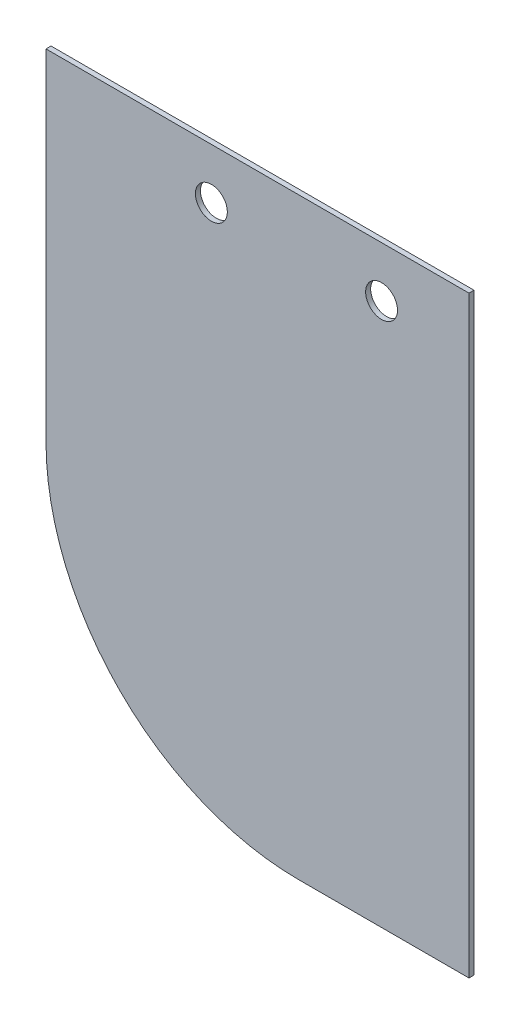
ISO-10303-21;
HEADER;
FILE_DESCRIPTION(('STEP AP214'),'2;1');
FILE_NAME('part.step','',(''),(''),'','','');
FILE_SCHEMA(('AUTOMOTIVE_DESIGN { 1 0 10303 214 1 1 1 1 }'));
ENDSEC;
DATA;
#1=APPLICATION_CONTEXT('core data for automotive mechanical design processes');
#2=APPLICATION_PROTOCOL_DEFINITION('international standard','automotive_design',2000,#1);
#3=PRODUCT_CONTEXT('',#1,'mechanical');
#4=PRODUCT('Part','Part','',(#3));
#5=PRODUCT_RELATED_PRODUCT_CATEGORY('part','',(#4));
#6=PRODUCT_DEFINITION_FORMATION('','',#4);
#7=PRODUCT_DEFINITION_CONTEXT('part definition',#1,'design');
#8=PRODUCT_DEFINITION('design','',#6,#7);
#9=PRODUCT_DEFINITION_SHAPE('','',#8);
#10=(LENGTH_UNIT() NAMED_UNIT(*) SI_UNIT(.MILLI.,.METRE.));
#11=(NAMED_UNIT(*) PLANE_ANGLE_UNIT() SI_UNIT($,.RADIAN.));
#12=(NAMED_UNIT(*) SI_UNIT($,.STERADIAN.) SOLID_ANGLE_UNIT());
#13=UNCERTAINTY_MEASURE_WITH_UNIT(LENGTH_MEASURE(1.E-05),#10,'distance_accuracy_value','');
#14=(GEOMETRIC_REPRESENTATION_CONTEXT(3) GLOBAL_UNCERTAINTY_ASSIGNED_CONTEXT((#13)) GLOBAL_UNIT_ASSIGNED_CONTEXT((#10,
#11,#12)) REPRESENTATION_CONTEXT('',''));
#15=CARTESIAN_POINT('',(0.,0.,0.));
#16=DIRECTION('',(0.,0.,1.));
#17=DIRECTION('',(1.,0.,0.));
#18=AXIS2_PLACEMENT_3D('',#15,#16,#17);
#19=CARTESIAN_POINT('',(-468.975,1066.8,1.5));
#20=DIRECTION('',(0.,0.,1.));
#21=DIRECTION('',(1.,0.,0.));
#22=AXIS2_PLACEMENT_3D('',#19,#20,#21);
#23=PLANE('',#22);
#24=CARTESIAN_POINT('',(-444.2625,1153.3,1.5));
#25=DIRECTION('',(0.,0.,1.));
#26=DIRECTION('',(1.,0.,0.));
#27=AXIS2_PLACEMENT_3D('',#24,#25,#26);
#28=CIRCLE('',#27,4.76250000000003);
#29=CARTESIAN_POINT('',(-439.5,1153.3,1.5));
#30=VERTEX_POINT('',#29);
#31=EDGE_CURVE('E135',#30,#30,#28,.T.);
#32=ORIENTED_EDGE('',*,*,#31,.F.);
#33=EDGE_LOOP('',(#32));
#34=FACE_BOUND('',#33,.T.);
#35=DIRECTION('',(0.,1.,0.));
#36=VECTOR('',#35,1.);
#37=CARTESIAN_POINT('',(-418.175,991.35,1.5));
#38=LINE('',#37,#36);
#39=CARTESIAN_POINT('',(-418.175,991.35,1.5));
#40=VERTEX_POINT('',#39);
#41=CARTESIAN_POINT('',(-418.175,1168.4,1.5));
#42=VERTEX_POINT('',#41);
#43=EDGE_CURVE('E143',#40,#42,#38,.T.);
#44=ORIENTED_EDGE('',*,*,#43,.T.);
#45=DIRECTION('',(-1.,0.,0.));
#46=VECTOR('',#45,1.);
#47=CARTESIAN_POINT('',(-544.425,1168.4,1.5));
#48=LINE('',#47,#46);
#49=CARTESIAN_POINT('',(-544.425,1168.4,1.5));
#50=VERTEX_POINT('',#49);
#51=EDGE_CURVE('E100',#42,#50,#48,.T.);
#52=ORIENTED_EDGE('',*,*,#51,.T.);
#53=DIRECTION('',(0.,-1.,0.));
#54=VECTOR('',#53,1.);
#55=CARTESIAN_POINT('',(-544.425,1066.8,1.5));
#56=LINE('',#55,#54);
#57=CARTESIAN_POINT('',(-544.425,1066.8,1.5));
#58=VERTEX_POINT('',#57);
#59=EDGE_CURVE('E105',#50,#58,#56,.T.);
#60=ORIENTED_EDGE('',*,*,#59,.T.);
#61=CARTESIAN_POINT('',(-468.975,1066.8,1.5));
#62=DIRECTION('',(0.,0.,1.));
#63=DIRECTION('',(1.,0.,0.));
#64=AXIS2_PLACEMENT_3D('',#61,#62,#63);
#65=CIRCLE('',#64,75.45);
#66=CARTESIAN_POINT('',(-468.975,991.35,1.5));
#67=VERTEX_POINT('',#66);
#68=EDGE_CURVE('E109',#58,#67,#65,.T.);
#69=ORIENTED_EDGE('',*,*,#68,.T.);
#70=DIRECTION('',(1.,0.,0.));
#71=VECTOR('',#70,1.);
#72=CARTESIAN_POINT('',(-418.175,991.35,1.5));
#73=LINE('',#72,#71);
#74=EDGE_CURVE('E60',#67,#40,#73,.T.);
#75=ORIENTED_EDGE('',*,*,#74,.T.);
#76=EDGE_LOOP('',(#44,#52,#60,#69,#75));
#77=FACE_BOUND('',#76,.T.);
#78=CARTESIAN_POINT('',(-495.0625,1153.3,1.5));
#79=DIRECTION('',(0.,0.,1.));
#80=DIRECTION('',(1.,0.,0.));
#81=AXIS2_PLACEMENT_3D('',#78,#79,#80);
#82=CIRCLE('',#81,4.76250000000003);
#83=CARTESIAN_POINT('',(-490.3,1153.3,1.5));
#84=VERTEX_POINT('',#83);
#85=EDGE_CURVE('E185',#84,#84,#82,.T.);
#86=ORIENTED_EDGE('',*,*,#85,.F.);
#87=EDGE_LOOP('',(#86));
#88=FACE_BOUND('',#87,.T.);
#89=ADVANCED_FACE('F39',(#34,#77,#88),#23,.T.);
#90=CARTESIAN_POINT('',(-468.975,1066.8,0.));
#91=DIRECTION('',(0.,0.,1.));
#92=DIRECTION('',(1.,0.,0.));
#93=AXIS2_PLACEMENT_3D('',#90,#91,#92);
#94=PLANE('',#93);
#95=CARTESIAN_POINT('',(-444.2625,1153.3,0.));
#96=DIRECTION('',(0.,0.,1.));
#97=DIRECTION('',(1.,0.,0.));
#98=AXIS2_PLACEMENT_3D('',#95,#96,#97);
#99=CIRCLE('',#98,4.76250000000003);
#100=CARTESIAN_POINT('',(-439.5,1153.3,0.));
#101=VERTEX_POINT('',#100);
#102=EDGE_CURVE('E193',#101,#101,#99,.T.);
#103=ORIENTED_EDGE('',*,*,#102,.T.);
#104=EDGE_LOOP('',(#103));
#105=FACE_BOUND('',#104,.T.);
#106=DIRECTION('',(0.,1.,0.));
#107=VECTOR('',#106,1.);
#108=CARTESIAN_POINT('',(-418.175,991.35,0.));
#109=LINE('',#108,#107);
#110=CARTESIAN_POINT('',(-418.175,991.35,0.));
#111=VERTEX_POINT('',#110);
#112=CARTESIAN_POINT('',(-418.175,1168.4,0.));
#113=VERTEX_POINT('',#112);
#114=EDGE_CURVE('E131',#111,#113,#109,.T.);
#115=ORIENTED_EDGE('',*,*,#114,.F.);
#116=DIRECTION('',(1.,0.,0.));
#117=VECTOR('',#116,1.);
#118=CARTESIAN_POINT('',(-418.175,991.35,0.));
#119=LINE('',#118,#117);
#120=CARTESIAN_POINT('',(-468.975,991.35,0.));
#121=VERTEX_POINT('',#120);
#122=EDGE_CURVE('E90',#121,#111,#119,.T.);
#123=ORIENTED_EDGE('',*,*,#122,.F.);
#124=CARTESIAN_POINT('',(-468.975,1066.8,0.));
#125=DIRECTION('',(0.,0.,1.));
#126=DIRECTION('',(1.,0.,0.));
#127=AXIS2_PLACEMENT_3D('',#124,#125,#126);
#128=CIRCLE('',#127,75.45);
#129=CARTESIAN_POINT('',(-544.425,1066.8,0.));
#130=VERTEX_POINT('',#129);
#131=EDGE_CURVE('E84',#130,#121,#128,.T.);
#132=ORIENTED_EDGE('',*,*,#131,.F.);
#133=DIRECTION('',(0.,-1.,0.));
#134=VECTOR('',#133,1.);
#135=CARTESIAN_POINT('',(-544.425,1066.8,0.));
#136=LINE('',#135,#134);
#137=CARTESIAN_POINT('',(-544.425,1168.4,0.));
#138=VERTEX_POINT('',#137);
#139=EDGE_CURVE('E117',#138,#130,#136,.T.);
#140=ORIENTED_EDGE('',*,*,#139,.F.);
#141=DIRECTION('',(-1.,0.,0.));
#142=VECTOR('',#141,1.);
#143=CARTESIAN_POINT('',(-544.425,1168.4,0.));
#144=LINE('',#143,#142);
#145=EDGE_CURVE('E134',#113,#138,#144,.T.);
#146=ORIENTED_EDGE('',*,*,#145,.F.);
#147=EDGE_LOOP('',(#115,#123,#132,#140,#146));
#148=FACE_BOUND('',#147,.T.);
#149=CARTESIAN_POINT('',(-495.0625,1153.3,0.));
#150=DIRECTION('',(0.,0.,1.));
#151=DIRECTION('',(1.,0.,0.));
#152=AXIS2_PLACEMENT_3D('',#149,#150,#151);
#153=CIRCLE('',#152,4.76250000000003);
#154=CARTESIAN_POINT('',(-490.3,1153.3,0.));
#155=VERTEX_POINT('',#154);
#156=EDGE_CURVE('E188',#155,#155,#153,.T.);
#157=ORIENTED_EDGE('',*,*,#156,.T.);
#158=EDGE_LOOP('',(#157));
#159=FACE_BOUND('',#158,.T.);
#160=ADVANCED_FACE('F151',(#105,#148,#159),#94,.F.);
#161=CARTESIAN_POINT('',(-418.175,991.35,1.5));
#162=DIRECTION('',(-1.,0.,0.));
#163=DIRECTION('',(0.,0.,1.));
#164=AXIS2_PLACEMENT_3D('',#161,#162,#163);
#165=PLANE('',#164);
#166=ORIENTED_EDGE('',*,*,#114,.T.);
#167=DIRECTION('',(0.,0.,-1.));
#168=VECTOR('',#167,1.);
#169=CARTESIAN_POINT('',(-418.175,1168.4,1.5));
#170=LINE('',#169,#168);
#171=EDGE_CURVE('E11',#42,#113,#170,.T.);
#172=ORIENTED_EDGE('',*,*,#171,.F.);
#173=ORIENTED_EDGE('',*,*,#43,.F.);
#174=DIRECTION('',(0.,0.,-1.));
#175=VECTOR('',#174,1.);
#176=CARTESIAN_POINT('',(-418.175,991.35,1.5));
#177=LINE('',#176,#175);
#178=EDGE_CURVE('E127',#40,#111,#177,.T.);
#179=ORIENTED_EDGE('',*,*,#178,.T.);
#180=EDGE_LOOP('',(#166,#172,#173,#179));
#181=FACE_BOUND('',#180,.T.);
#182=ADVANCED_FACE('F41',(#181),#165,.F.);
#183=CARTESIAN_POINT('',(-544.425,1168.4,1.5));
#184=DIRECTION('',(0.,-1.,0.));
#185=DIRECTION('',(0.,0.,-1.));
#186=AXIS2_PLACEMENT_3D('',#183,#184,#185);
#187=PLANE('',#186);
#188=ORIENTED_EDGE('',*,*,#145,.T.);
#189=DIRECTION('',(0.,0.,-1.));
#190=VECTOR('',#189,1.);
#191=CARTESIAN_POINT('',(-544.425,1168.4,1.5));
#192=LINE('',#191,#190);
#193=EDGE_CURVE('E49',#50,#138,#192,.T.);
#194=ORIENTED_EDGE('',*,*,#193,.F.);
#195=ORIENTED_EDGE('',*,*,#51,.F.);
#196=ORIENTED_EDGE('',*,*,#171,.T.);
#197=EDGE_LOOP('',(#188,#194,#195,#196));
#198=FACE_BOUND('',#197,.T.);
#199=ADVANCED_FACE('F227',(#198),#187,.F.);
#200=CARTESIAN_POINT('',(-544.425,1066.8,1.5));
#201=DIRECTION('',(1.,0.,0.));
#202=DIRECTION('',(0.,0.,-1.));
#203=AXIS2_PLACEMENT_3D('',#200,#201,#202);
#204=PLANE('',#203);
#205=ORIENTED_EDGE('',*,*,#139,.T.);
#206=DIRECTION('',(0.,0.,-1.));
#207=VECTOR('',#206,1.);
#208=CARTESIAN_POINT('',(-544.425,1066.8,1.5));
#209=LINE('',#208,#207);
#210=EDGE_CURVE('E114',#58,#130,#209,.T.);
#211=ORIENTED_EDGE('',*,*,#210,.F.);
#212=ORIENTED_EDGE('',*,*,#59,.F.);
#213=ORIENTED_EDGE('',*,*,#193,.T.);
#214=EDGE_LOOP('',(#205,#211,#212,#213));
#215=FACE_BOUND('',#214,.T.);
#216=ADVANCED_FACE('F115',(#215),#204,.F.);
#217=CARTESIAN_POINT('',(-468.975,1066.8,1.5));
#218=DIRECTION('',(0.,0.,-1.));
#219=DIRECTION('',(-1.,0.,0.));
#220=AXIS2_PLACEMENT_3D('',#217,#218,#219);
#221=CYLINDRICAL_SURFACE('',#220,75.45);
#222=ORIENTED_EDGE('',*,*,#131,.T.);
#223=DIRECTION('',(0.,0.,-1.));
#224=VECTOR('',#223,1.);
#225=CARTESIAN_POINT('',(-468.975,991.35,1.5));
#226=LINE('',#225,#224);
#227=EDGE_CURVE('E119',#67,#121,#226,.T.);
#228=ORIENTED_EDGE('',*,*,#227,.F.);
#229=ORIENTED_EDGE('',*,*,#68,.F.);
#230=ORIENTED_EDGE('',*,*,#210,.T.);
#231=EDGE_LOOP('',(#222,#228,#229,#230));
#232=FACE_BOUND('',#231,.T.);
#233=ADVANCED_FACE('F121',(#232),#221,.T.);
#234=CARTESIAN_POINT('',(-418.175,991.35,1.5));
#235=DIRECTION('',(0.,1.,0.));
#236=DIRECTION('',(0.,0.,1.));
#237=AXIS2_PLACEMENT_3D('',#234,#235,#236);
#238=PLANE('',#237);
#239=ORIENTED_EDGE('',*,*,#122,.T.);
#240=ORIENTED_EDGE('',*,*,#178,.F.);
#241=ORIENTED_EDGE('',*,*,#74,.F.);
#242=ORIENTED_EDGE('',*,*,#227,.T.);
#243=EDGE_LOOP('',(#239,#240,#241,#242));
#244=FACE_BOUND('',#243,.T.);
#245=ADVANCED_FACE('F156',(#244),#238,.F.);
#246=CARTESIAN_POINT('',(-444.2625,1153.3,1.5));
#247=DIRECTION('',(0.,0.,-1.));
#248=DIRECTION('',(-1.,0.,0.));
#249=AXIS2_PLACEMENT_3D('',#246,#247,#248);
#250=CYLINDRICAL_SURFACE('',#249,4.76250000000003);
#251=ORIENTED_EDGE('',*,*,#31,.T.);
#252=EDGE_LOOP('',(#251));
#253=FACE_BOUND('',#252,.T.);
#254=ORIENTED_EDGE('',*,*,#102,.F.);
#255=EDGE_LOOP('',(#254));
#256=FACE_BOUND('',#255,.T.);
#257=ADVANCED_FACE('F158',(#253,#256),#250,.F.);
#258=CARTESIAN_POINT('',(-495.0625,1153.3,1.5));
#259=DIRECTION('',(0.,0.,-1.));
#260=DIRECTION('',(-1.,0.,0.));
#261=AXIS2_PLACEMENT_3D('',#258,#259,#260);
#262=CYLINDRICAL_SURFACE('',#261,4.76250000000003);
#263=ORIENTED_EDGE('',*,*,#85,.T.);
#264=EDGE_LOOP('',(#263));
#265=FACE_BOUND('',#264,.T.);
#266=ORIENTED_EDGE('',*,*,#156,.F.);
#267=EDGE_LOOP('',(#266));
#268=FACE_BOUND('',#267,.T.);
#269=ADVANCED_FACE('F164',(#265,#268),#262,.F.);
#270=CLOSED_SHELL('',(#89,#160,#182,#199,#216,#233,#245,#257,#269));
#271=MANIFOLD_SOLID_BREP('B2',#270);
#272=ADVANCED_BREP_SHAPE_REPRESENTATION('',(#18,#271),#14);
#273=SHAPE_DEFINITION_REPRESENTATION(#9,#272);
ENDSEC;
END-ISO-10303-21;
